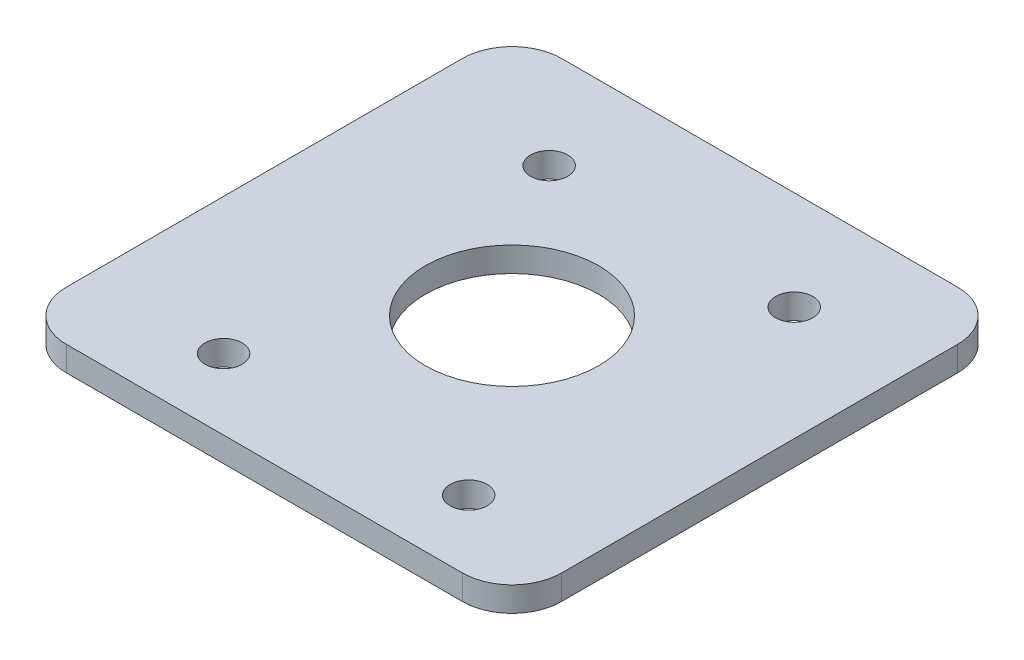
ISO-10303-21;
HEADER;
FILE_DESCRIPTION(('STEP AP214'),'2;1');
FILE_NAME('part.step','',(''),(''),'','','');
FILE_SCHEMA(('AUTOMOTIVE_DESIGN { 1 0 10303 214 1 1 1 1 }'));
ENDSEC;
DATA;
#1=APPLICATION_CONTEXT('core data for automotive mechanical design processes');
#2=APPLICATION_PROTOCOL_DEFINITION('international standard','automotive_design',2000,#1);
#3=PRODUCT_CONTEXT('',#1,'mechanical');
#4=PRODUCT('Part','Part','',(#3));
#5=PRODUCT_RELATED_PRODUCT_CATEGORY('part','',(#4));
#6=PRODUCT_DEFINITION_FORMATION('','',#4);
#7=PRODUCT_DEFINITION_CONTEXT('part definition',#1,'design');
#8=PRODUCT_DEFINITION('design','',#6,#7);
#9=PRODUCT_DEFINITION_SHAPE('','',#8);
#10=(LENGTH_UNIT() NAMED_UNIT(*) SI_UNIT(.MILLI.,.METRE.));
#11=(NAMED_UNIT(*) PLANE_ANGLE_UNIT() SI_UNIT($,.RADIAN.));
#12=(NAMED_UNIT(*) SI_UNIT($,.STERADIAN.) SOLID_ANGLE_UNIT());
#13=UNCERTAINTY_MEASURE_WITH_UNIT(LENGTH_MEASURE(1.E-05),#10,'distance_accuracy_value','');
#14=(GEOMETRIC_REPRESENTATION_CONTEXT(3) GLOBAL_UNCERTAINTY_ASSIGNED_CONTEXT((#13)) GLOBAL_UNIT_ASSIGNED_CONTEXT((#10,
#11,#12)) REPRESENTATION_CONTEXT('',''));
#15=CARTESIAN_POINT('',(0.,0.,0.));
#16=DIRECTION('',(0.,0.,1.));
#17=DIRECTION('',(1.,0.,0.));
#18=AXIS2_PLACEMENT_3D('',#15,#16,#17);
#19=CARTESIAN_POINT('',(0.,2.,0.));
#20=DIRECTION('',(0.,1.,0.));
#21=DIRECTION('',(0.,0.,1.));
#22=AXIS2_PLACEMENT_3D('',#19,#20,#21);
#23=PLANE('',#22);
#24=CARTESIAN_POINT('',(10.8,2.,14.3));
#25=DIRECTION('',(0.,1.,0.));
#26=DIRECTION('',(0.,0.,1.));
#27=AXIS2_PLACEMENT_3D('',#24,#25,#26);
#28=CIRCLE('',#27,1.5);
#29=CARTESIAN_POINT('',(10.8,2.,15.8));
#30=VERTEX_POINT('',#29);
#31=EDGE_CURVE('E192',#30,#30,#28,.T.);
#32=ORIENTED_EDGE('',*,*,#31,.F.);
#33=EDGE_LOOP('',(#32));
#34=FACE_BOUND('',#33,.T.);
#35=CARTESIAN_POINT('',(0.,2.,0.));
#36=DIRECTION('',(0.,1.,0.));
#37=DIRECTION('',(0.,0.,1.));
#38=AXIS2_PLACEMENT_3D('',#35,#36,#37);
#39=CIRCLE('',#38,7.00000000000002);
#40=CARTESIAN_POINT('',(0.,2.,7.00000000000002));
#41=VERTEX_POINT('',#40);
#42=EDGE_CURVE('E181',#41,#41,#39,.T.);
#43=ORIENTED_EDGE('',*,*,#42,.F.);
#44=EDGE_LOOP('',(#43));
#45=FACE_BOUND('',#44,.T.);
#46=DIRECTION('',(0.,0.,1.));
#47=VECTOR('',#46,1.);
#48=CARTESIAN_POINT('',(-20.,2.,-20.));
#49=LINE('',#48,#47);
#50=CARTESIAN_POINT('',(-20.,2.,-16.));
#51=VERTEX_POINT('',#50);
#52=CARTESIAN_POINT('',(-20.,2.,16.));
#53=VERTEX_POINT('',#52);
#54=EDGE_CURVE('E176',#51,#53,#49,.T.);
#55=ORIENTED_EDGE('',*,*,#54,.T.);
#56=CARTESIAN_POINT('',(-16.,2.,16.));
#57=DIRECTION('',(0.,1.,0.));
#58=DIRECTION('',(0.,0.,1.));
#59=AXIS2_PLACEMENT_3D('',#56,#57,#58);
#60=CIRCLE('',#59,4.);
#61=CARTESIAN_POINT('',(-16.,2.,20.));
#62=VERTEX_POINT('',#61);
#63=EDGE_CURVE('E153',#53,#62,#60,.T.);
#64=ORIENTED_EDGE('',*,*,#63,.T.);
#65=DIRECTION('',(1.,0.,0.));
#66=VECTOR('',#65,1.);
#67=CARTESIAN_POINT('',(-20.,2.,20.));
#68=LINE('',#67,#66);
#69=CARTESIAN_POINT('',(16.,2.,20.));
#70=VERTEX_POINT('',#69);
#71=EDGE_CURVE('E124',#62,#70,#68,.T.);
#72=ORIENTED_EDGE('',*,*,#71,.T.);
#73=CARTESIAN_POINT('',(16.,2.,16.));
#74=DIRECTION('',(0.,1.,0.));
#75=DIRECTION('',(0.,0.,1.));
#76=AXIS2_PLACEMENT_3D('',#73,#74,#75);
#77=CIRCLE('',#76,4.);
#78=CARTESIAN_POINT('',(20.,2.,16.));
#79=VERTEX_POINT('',#78);
#80=EDGE_CURVE('E151',#70,#79,#77,.T.);
#81=ORIENTED_EDGE('',*,*,#80,.T.);
#82=DIRECTION('',(0.,0.,-1.));
#83=VECTOR('',#82,1.);
#84=CARTESIAN_POINT('',(20.,2.,-20.));
#85=LINE('',#84,#83);
#86=CARTESIAN_POINT('',(20.,2.,-16.));
#87=VERTEX_POINT('',#86);
#88=EDGE_CURVE('E131',#79,#87,#85,.T.);
#89=ORIENTED_EDGE('',*,*,#88,.T.);
#90=CARTESIAN_POINT('',(16.,2.,-16.));
#91=DIRECTION('',(0.,1.,0.));
#92=DIRECTION('',(0.,0.,1.));
#93=AXIS2_PLACEMENT_3D('',#90,#91,#92);
#94=CIRCLE('',#93,4.);
#95=CARTESIAN_POINT('',(16.,2.,-20.));
#96=VERTEX_POINT('',#95);
#97=EDGE_CURVE('E59',#87,#96,#94,.T.);
#98=ORIENTED_EDGE('',*,*,#97,.T.);
#99=DIRECTION('',(-1.,0.,0.));
#100=VECTOR('',#99,1.);
#101=CARTESIAN_POINT('',(-20.,2.,-20.));
#102=LINE('',#101,#100);
#103=CARTESIAN_POINT('',(-16.,2.,-20.));
#104=VERTEX_POINT('',#103);
#105=EDGE_CURVE('E134',#96,#104,#102,.T.);
#106=ORIENTED_EDGE('',*,*,#105,.T.);
#107=CARTESIAN_POINT('',(-16.,2.,-16.));
#108=DIRECTION('',(0.,1.,0.));
#109=DIRECTION('',(0.,0.,1.));
#110=AXIS2_PLACEMENT_3D('',#107,#108,#109);
#111=CIRCLE('',#110,4.);
#112=EDGE_CURVE('E148',#104,#51,#111,.T.);
#113=ORIENTED_EDGE('',*,*,#112,.T.);
#114=EDGE_LOOP('',(#55,#64,#72,#81,#89,#98,#106,#113));
#115=FACE_BOUND('',#114,.T.);
#116=CARTESIAN_POINT('',(-9.,2.,-12.));
#117=DIRECTION('',(0.,1.,0.));
#118=DIRECTION('',(0.,0.,1.));
#119=AXIS2_PLACEMENT_3D('',#116,#117,#118);
#120=CIRCLE('',#119,1.5);
#121=CARTESIAN_POINT('',(-9.,2.,-10.5));
#122=VERTEX_POINT('',#121);
#123=EDGE_CURVE('E169',#122,#122,#120,.T.);
#124=ORIENTED_EDGE('',*,*,#123,.F.);
#125=EDGE_LOOP('',(#124));
#126=FACE_BOUND('',#125,.T.);
#127=CARTESIAN_POINT('',(-9.,2.,14.3));
#128=DIRECTION('',(0.,1.,0.));
#129=DIRECTION('',(0.,0.,1.));
#130=AXIS2_PLACEMENT_3D('',#127,#128,#129);
#131=CIRCLE('',#130,1.5);
#132=CARTESIAN_POINT('',(-9.,2.,15.8));
#133=VERTEX_POINT('',#132);
#134=EDGE_CURVE('E186',#133,#133,#131,.T.);
#135=ORIENTED_EDGE('',*,*,#134,.F.);
#136=EDGE_LOOP('',(#135));
#137=FACE_BOUND('',#136,.T.);
#138=CARTESIAN_POINT('',(10.8,2.,-12.));
#139=DIRECTION('',(0.,1.,0.));
#140=DIRECTION('',(0.,0.,1.));
#141=AXIS2_PLACEMENT_3D('',#138,#139,#140);
#142=CIRCLE('',#141,1.5);
#143=CARTESIAN_POINT('',(10.8,2.,-10.5));
#144=VERTEX_POINT('',#143);
#145=EDGE_CURVE('E198',#144,#144,#142,.T.);
#146=ORIENTED_EDGE('',*,*,#145,.F.);
#147=EDGE_LOOP('',(#146));
#148=FACE_BOUND('',#147,.T.);
#149=ADVANCED_FACE('F38',(#34,#45,#115,#126,#137,#148),#23,.T.);
#150=CARTESIAN_POINT('',(0.,0.,0.));
#151=DIRECTION('',(0.,1.,0.));
#152=DIRECTION('',(0.,0.,1.));
#153=AXIS2_PLACEMENT_3D('',#150,#151,#152);
#154=PLANE('',#153);
#155=DIRECTION('',(1.,0.,0.));
#156=VECTOR('',#155,1.);
#157=CARTESIAN_POINT('',(-20.,0.,20.));
#158=LINE('',#157,#156);
#159=CARTESIAN_POINT('',(-16.,0.,20.));
#160=VERTEX_POINT('',#159);
#161=CARTESIAN_POINT('',(16.,0.,20.));
#162=VERTEX_POINT('',#161);
#163=EDGE_CURVE('E121',#160,#162,#158,.T.);
#164=ORIENTED_EDGE('',*,*,#163,.F.);
#165=CARTESIAN_POINT('',(-16.,0.,16.));
#166=DIRECTION('',(0.,1.,0.));
#167=DIRECTION('',(0.,0.,1.));
#168=AXIS2_PLACEMENT_3D('',#165,#166,#167);
#169=CIRCLE('',#168,4.);
#170=CARTESIAN_POINT('',(-20.,0.,16.));
#171=VERTEX_POINT('',#170);
#172=EDGE_CURVE('E104',#160,#171,#169,.F.);
#173=ORIENTED_EDGE('',*,*,#172,.T.);
#174=DIRECTION('',(0.,0.,1.));
#175=VECTOR('',#174,1.);
#176=CARTESIAN_POINT('',(-20.,0.,-20.));
#177=LINE('',#176,#175);
#178=CARTESIAN_POINT('',(-20.,0.,-16.));
#179=VERTEX_POINT('',#178);
#180=EDGE_CURVE('E132',#179,#171,#177,.T.);
#181=ORIENTED_EDGE('',*,*,#180,.F.);
#182=CARTESIAN_POINT('',(-16.,0.,-16.));
#183=DIRECTION('',(0.,1.,0.));
#184=DIRECTION('',(0.,0.,1.));
#185=AXIS2_PLACEMENT_3D('',#182,#183,#184);
#186=CIRCLE('',#185,4.);
#187=CARTESIAN_POINT('',(-16.,0.,-20.));
#188=VERTEX_POINT('',#187);
#189=EDGE_CURVE('E125',#179,#188,#186,.F.);
#190=ORIENTED_EDGE('',*,*,#189,.T.);
#191=DIRECTION('',(-1.,0.,0.));
#192=VECTOR('',#191,1.);
#193=CARTESIAN_POINT('',(-20.,0.,-20.));
#194=LINE('',#193,#192);
#195=CARTESIAN_POINT('',(16.,0.,-20.));
#196=VERTEX_POINT('',#195);
#197=EDGE_CURVE('E136',#196,#188,#194,.T.);
#198=ORIENTED_EDGE('',*,*,#197,.F.);
#199=CARTESIAN_POINT('',(16.,0.,-16.));
#200=DIRECTION('',(0.,1.,0.));
#201=DIRECTION('',(0.,0.,1.));
#202=AXIS2_PLACEMENT_3D('',#199,#200,#201);
#203=CIRCLE('',#202,4.);
#204=CARTESIAN_POINT('',(20.,0.,-16.));
#205=VERTEX_POINT('',#204);
#206=EDGE_CURVE('E142',#196,#205,#203,.F.);
#207=ORIENTED_EDGE('',*,*,#206,.T.);
#208=DIRECTION('',(0.,0.,-1.));
#209=VECTOR('',#208,1.);
#210=CARTESIAN_POINT('',(20.,0.,-20.));
#211=LINE('',#210,#209);
#212=CARTESIAN_POINT('',(20.,0.,16.));
#213=VERTEX_POINT('',#212);
#214=EDGE_CURVE('E164',#213,#205,#211,.T.);
#215=ORIENTED_EDGE('',*,*,#214,.F.);
#216=CARTESIAN_POINT('',(16.,0.,16.));
#217=DIRECTION('',(0.,1.,0.));
#218=DIRECTION('',(0.,0.,1.));
#219=AXIS2_PLACEMENT_3D('',#216,#217,#218);
#220=CIRCLE('',#219,4.);
#221=EDGE_CURVE('E115',#213,#162,#220,.F.);
#222=ORIENTED_EDGE('',*,*,#221,.T.);
#223=EDGE_LOOP('',(#164,#173,#181,#190,#198,#207,#215,#222));
#224=FACE_BOUND('',#223,.T.);
#225=CARTESIAN_POINT('',(-9.,0.,-12.));
#226=DIRECTION('',(0.,1.,0.));
#227=DIRECTION('',(0.,0.,1.));
#228=AXIS2_PLACEMENT_3D('',#225,#226,#227);
#229=CIRCLE('',#228,1.5);
#230=CARTESIAN_POINT('',(-9.,0.,-10.5));
#231=VERTEX_POINT('',#230);
#232=EDGE_CURVE('E172',#231,#231,#229,.T.);
#233=ORIENTED_EDGE('',*,*,#232,.T.);
#234=EDGE_LOOP('',(#233));
#235=FACE_BOUND('',#234,.T.);
#236=CARTESIAN_POINT('',(0.,0.,0.));
#237=DIRECTION('',(0.,1.,0.));
#238=DIRECTION('',(0.,0.,1.));
#239=AXIS2_PLACEMENT_3D('',#236,#237,#238);
#240=CIRCLE('',#239,7.00000000000002);
#241=CARTESIAN_POINT('',(0.,0.,7.00000000000002));
#242=VERTEX_POINT('',#241);
#243=EDGE_CURVE('E183',#242,#242,#240,.T.);
#244=ORIENTED_EDGE('',*,*,#243,.T.);
#245=EDGE_LOOP('',(#244));
#246=FACE_BOUND('',#245,.T.);
#247=CARTESIAN_POINT('',(-9.,0.,14.3));
#248=DIRECTION('',(0.,1.,0.));
#249=DIRECTION('',(0.,0.,1.));
#250=AXIS2_PLACEMENT_3D('',#247,#248,#249);
#251=CIRCLE('',#250,1.5);
#252=CARTESIAN_POINT('',(-9.,0.,15.8));
#253=VERTEX_POINT('',#252);
#254=EDGE_CURVE('E189',#253,#253,#251,.T.);
#255=ORIENTED_EDGE('',*,*,#254,.T.);
#256=EDGE_LOOP('',(#255));
#257=FACE_BOUND('',#256,.T.);
#258=CARTESIAN_POINT('',(10.8,0.,14.3));
#259=DIRECTION('',(0.,1.,0.));
#260=DIRECTION('',(0.,0.,1.));
#261=AXIS2_PLACEMENT_3D('',#258,#259,#260);
#262=CIRCLE('',#261,1.5);
#263=CARTESIAN_POINT('',(10.8,0.,15.8));
#264=VERTEX_POINT('',#263);
#265=EDGE_CURVE('E195',#264,#264,#262,.T.);
#266=ORIENTED_EDGE('',*,*,#265,.T.);
#267=EDGE_LOOP('',(#266));
#268=FACE_BOUND('',#267,.T.);
#269=CARTESIAN_POINT('',(10.8,0.,-12.));
#270=DIRECTION('',(0.,1.,0.));
#271=DIRECTION('',(0.,0.,1.));
#272=AXIS2_PLACEMENT_3D('',#269,#270,#271);
#273=CIRCLE('',#272,1.5);
#274=CARTESIAN_POINT('',(10.8,0.,-10.5));
#275=VERTEX_POINT('',#274);
#276=EDGE_CURVE('E201',#275,#275,#273,.T.);
#277=ORIENTED_EDGE('',*,*,#276,.T.);
#278=EDGE_LOOP('',(#277));
#279=FACE_BOUND('',#278,.T.);
#280=ADVANCED_FACE('F128',(#224,#235,#246,#257,#268,#279),#154,.F.);
#281=CARTESIAN_POINT('',(20.,2.,-20.));
#282=DIRECTION('',(-1.,0.,0.));
#283=DIRECTION('',(0.,0.,1.));
#284=AXIS2_PLACEMENT_3D('',#281,#282,#283);
#285=PLANE('',#284);
#286=ORIENTED_EDGE('',*,*,#88,.F.);
#287=DIRECTION('',(0.,-1.,0.));
#288=VECTOR('',#287,1.);
#289=CARTESIAN_POINT('',(20.,2.,16.));
#290=LINE('',#289,#288);
#291=EDGE_CURVE('E157',#79,#213,#290,.T.);
#292=ORIENTED_EDGE('',*,*,#291,.T.);
#293=ORIENTED_EDGE('',*,*,#214,.T.);
#294=DIRECTION('',(0.,-1.,0.));
#295=VECTOR('',#294,1.);
#296=CARTESIAN_POINT('',(20.,2.,-16.));
#297=LINE('',#296,#295);
#298=EDGE_CURVE('E155',#205,#87,#297,.F.);
#299=ORIENTED_EDGE('',*,*,#298,.T.);
#300=EDGE_LOOP('',(#286,#292,#293,#299));
#301=FACE_BOUND('',#300,.T.);
#302=ADVANCED_FACE('F163',(#301),#285,.F.);
#303=CARTESIAN_POINT('',(-20.,2.,-20.));
#304=DIRECTION('',(0.,0.,1.));
#305=DIRECTION('',(1.,0.,0.));
#306=AXIS2_PLACEMENT_3D('',#303,#304,#305);
#307=PLANE('',#306);
#308=ORIENTED_EDGE('',*,*,#105,.F.);
#309=DIRECTION('',(0.,-1.,0.));
#310=VECTOR('',#309,1.);
#311=CARTESIAN_POINT('',(16.,2.,-20.));
#312=LINE('',#311,#310);
#313=EDGE_CURVE('E11',#96,#196,#312,.T.);
#314=ORIENTED_EDGE('',*,*,#313,.T.);
#315=ORIENTED_EDGE('',*,*,#197,.T.);
#316=DIRECTION('',(0.,-1.,0.));
#317=VECTOR('',#316,1.);
#318=CARTESIAN_POINT('',(-16.,2.,-20.));
#319=LINE('',#318,#317);
#320=EDGE_CURVE('E46',#188,#104,#319,.F.);
#321=ORIENTED_EDGE('',*,*,#320,.T.);
#322=EDGE_LOOP('',(#308,#314,#315,#321));
#323=FACE_BOUND('',#322,.T.);
#324=ADVANCED_FACE('F229',(#323),#307,.F.);
#325=CARTESIAN_POINT('',(-20.,2.,-20.));
#326=DIRECTION('',(1.,0.,0.));
#327=DIRECTION('',(0.,0.,-1.));
#328=AXIS2_PLACEMENT_3D('',#325,#326,#327);
#329=PLANE('',#328);
#330=ORIENTED_EDGE('',*,*,#180,.T.);
#331=DIRECTION('',(0.,-1.,0.));
#332=VECTOR('',#331,1.);
#333=CARTESIAN_POINT('',(-20.,2.,16.));
#334=LINE('',#333,#332);
#335=EDGE_CURVE('E109',#171,#53,#334,.F.);
#336=ORIENTED_EDGE('',*,*,#335,.T.);
#337=ORIENTED_EDGE('',*,*,#54,.F.);
#338=DIRECTION('',(0.,-1.,0.));
#339=VECTOR('',#338,1.);
#340=CARTESIAN_POINT('',(-20.,2.,-16.));
#341=LINE('',#340,#339);
#342=EDGE_CURVE('E114',#51,#179,#341,.T.);
#343=ORIENTED_EDGE('',*,*,#342,.T.);
#344=EDGE_LOOP('',(#330,#336,#337,#343));
#345=FACE_BOUND('',#344,.T.);
#346=ADVANCED_FACE('F226',(#345),#329,.F.);
#347=CARTESIAN_POINT('',(-20.,2.,20.));
#348=DIRECTION('',(0.,0.,-1.));
#349=DIRECTION('',(-1.,0.,0.));
#350=AXIS2_PLACEMENT_3D('',#347,#348,#349);
#351=PLANE('',#350);
#352=ORIENTED_EDGE('',*,*,#71,.F.);
#353=DIRECTION('',(0.,-1.,0.));
#354=VECTOR('',#353,1.);
#355=CARTESIAN_POINT('',(-16.,2.,20.));
#356=LINE('',#355,#354);
#357=EDGE_CURVE('E108',#62,#160,#356,.T.);
#358=ORIENTED_EDGE('',*,*,#357,.T.);
#359=ORIENTED_EDGE('',*,*,#163,.T.);
#360=DIRECTION('',(0.,-1.,0.));
#361=VECTOR('',#360,1.);
#362=CARTESIAN_POINT('',(16.,2.,20.));
#363=LINE('',#362,#361);
#364=EDGE_CURVE('E126',#162,#70,#363,.F.);
#365=ORIENTED_EDGE('',*,*,#364,.T.);
#366=EDGE_LOOP('',(#352,#358,#359,#365));
#367=FACE_BOUND('',#366,.T.);
#368=ADVANCED_FACE('F120',(#367),#351,.F.);
#369=CARTESIAN_POINT('',(-9.,2.,-12.));
#370=DIRECTION('',(0.,-1.,0.));
#371=DIRECTION('',(0.,0.,-1.));
#372=AXIS2_PLACEMENT_3D('',#369,#370,#371);
#373=CYLINDRICAL_SURFACE('',#372,1.5);
#374=ORIENTED_EDGE('',*,*,#123,.T.);
#375=EDGE_LOOP('',(#374));
#376=FACE_BOUND('',#375,.T.);
#377=ORIENTED_EDGE('',*,*,#232,.F.);
#378=EDGE_LOOP('',(#377));
#379=FACE_BOUND('',#378,.T.);
#380=ADVANCED_FACE('F221',(#376,#379),#373,.F.);
#381=CARTESIAN_POINT('',(0.,2.,0.));
#382=DIRECTION('',(0.,-1.,0.));
#383=DIRECTION('',(0.,0.,-1.));
#384=AXIS2_PLACEMENT_3D('',#381,#382,#383);
#385=CYLINDRICAL_SURFACE('',#384,7.00000000000002);
#386=ORIENTED_EDGE('',*,*,#42,.T.);
#387=EDGE_LOOP('',(#386));
#388=FACE_BOUND('',#387,.T.);
#389=ORIENTED_EDGE('',*,*,#243,.F.);
#390=EDGE_LOOP('',(#389));
#391=FACE_BOUND('',#390,.T.);
#392=ADVANCED_FACE('F259',(#388,#391),#385,.F.);
#393=CARTESIAN_POINT('',(-9.,2.,14.3));
#394=DIRECTION('',(0.,-1.,0.));
#395=DIRECTION('',(0.,0.,-1.));
#396=AXIS2_PLACEMENT_3D('',#393,#394,#395);
#397=CYLINDRICAL_SURFACE('',#396,1.5);
#398=ORIENTED_EDGE('',*,*,#134,.T.);
#399=EDGE_LOOP('',(#398));
#400=FACE_BOUND('',#399,.T.);
#401=ORIENTED_EDGE('',*,*,#254,.F.);
#402=EDGE_LOOP('',(#401));
#403=FACE_BOUND('',#402,.T.);
#404=ADVANCED_FACE('F255',(#400,#403),#397,.F.);
#405=CARTESIAN_POINT('',(10.8,2.,14.3));
#406=DIRECTION('',(0.,-1.,0.));
#407=DIRECTION('',(0.,0.,-1.));
#408=AXIS2_PLACEMENT_3D('',#405,#406,#407);
#409=CYLINDRICAL_SURFACE('',#408,1.5);
#410=ORIENTED_EDGE('',*,*,#31,.T.);
#411=EDGE_LOOP('',(#410));
#412=FACE_BOUND('',#411,.T.);
#413=ORIENTED_EDGE('',*,*,#265,.F.);
#414=EDGE_LOOP('',(#413));
#415=FACE_BOUND('',#414,.T.);
#416=ADVANCED_FACE('F258',(#412,#415),#409,.F.);
#417=CARTESIAN_POINT('',(10.8,2.,-12.));
#418=DIRECTION('',(0.,-1.,0.));
#419=DIRECTION('',(0.,0.,-1.));
#420=AXIS2_PLACEMENT_3D('',#417,#418,#419);
#421=CYLINDRICAL_SURFACE('',#420,1.5);
#422=ORIENTED_EDGE('',*,*,#145,.T.);
#423=EDGE_LOOP('',(#422));
#424=FACE_BOUND('',#423,.T.);
#425=ORIENTED_EDGE('',*,*,#276,.F.);
#426=EDGE_LOOP('',(#425));
#427=FACE_BOUND('',#426,.T.);
#428=ADVANCED_FACE('F207',(#424,#427),#421,.F.);
#429=CARTESIAN_POINT('',(-16.,2.,16.));
#430=DIRECTION('',(0.,-1.,0.));
#431=DIRECTION('',(0.,0.,-1.));
#432=AXIS2_PLACEMENT_3D('',#429,#430,#431);
#433=CYLINDRICAL_SURFACE('',#432,4.);
#434=ORIENTED_EDGE('',*,*,#63,.F.);
#435=ORIENTED_EDGE('',*,*,#335,.F.);
#436=ORIENTED_EDGE('',*,*,#172,.F.);
#437=ORIENTED_EDGE('',*,*,#357,.F.);
#438=EDGE_LOOP('',(#434,#435,#436,#437));
#439=FACE_BOUND('',#438,.T.);
#440=ADVANCED_FACE('F107',(#439),#433,.T.);
#441=CARTESIAN_POINT('',(16.,2.,16.));
#442=DIRECTION('',(0.,-1.,0.));
#443=DIRECTION('',(0.,0.,-1.));
#444=AXIS2_PLACEMENT_3D('',#441,#442,#443);
#445=CYLINDRICAL_SURFACE('',#444,4.);
#446=ORIENTED_EDGE('',*,*,#80,.F.);
#447=ORIENTED_EDGE('',*,*,#364,.F.);
#448=ORIENTED_EDGE('',*,*,#221,.F.);
#449=ORIENTED_EDGE('',*,*,#291,.F.);
#450=EDGE_LOOP('',(#446,#447,#448,#449));
#451=FACE_BOUND('',#450,.T.);
#452=ADVANCED_FACE('F237',(#451),#445,.T.);
#453=CARTESIAN_POINT('',(16.,2.,-16.));
#454=DIRECTION('',(0.,-1.,0.));
#455=DIRECTION('',(0.,0.,-1.));
#456=AXIS2_PLACEMENT_3D('',#453,#454,#455);
#457=CYLINDRICAL_SURFACE('',#456,4.);
#458=ORIENTED_EDGE('',*,*,#97,.F.);
#459=ORIENTED_EDGE('',*,*,#298,.F.);
#460=ORIENTED_EDGE('',*,*,#206,.F.);
#461=ORIENTED_EDGE('',*,*,#313,.F.);
#462=EDGE_LOOP('',(#458,#459,#460,#461));
#463=FACE_BOUND('',#462,.T.);
#464=ADVANCED_FACE('F239',(#463),#457,.T.);
#465=CARTESIAN_POINT('',(-16.,2.,-16.));
#466=DIRECTION('',(0.,-1.,0.));
#467=DIRECTION('',(0.,0.,-1.));
#468=AXIS2_PLACEMENT_3D('',#465,#466,#467);
#469=CYLINDRICAL_SURFACE('',#468,4.);
#470=ORIENTED_EDGE('',*,*,#112,.F.);
#471=ORIENTED_EDGE('',*,*,#320,.F.);
#472=ORIENTED_EDGE('',*,*,#189,.F.);
#473=ORIENTED_EDGE('',*,*,#342,.F.);
#474=EDGE_LOOP('',(#470,#471,#472,#473));
#475=FACE_BOUND('',#474,.T.);
#476=ADVANCED_FACE('F40',(#475),#469,.T.);
#477=CLOSED_SHELL('',(#149,#280,#302,#324,#346,#368,#380,#392,#404,#416,#428,#440,#452,#464,#476));
#478=MANIFOLD_SOLID_BREP('B2',#477);
#479=ADVANCED_BREP_SHAPE_REPRESENTATION('',(#18,#478),#14);
#480=SHAPE_DEFINITION_REPRESENTATION(#9,#479);
ENDSEC;
END-ISO-10303-21;
